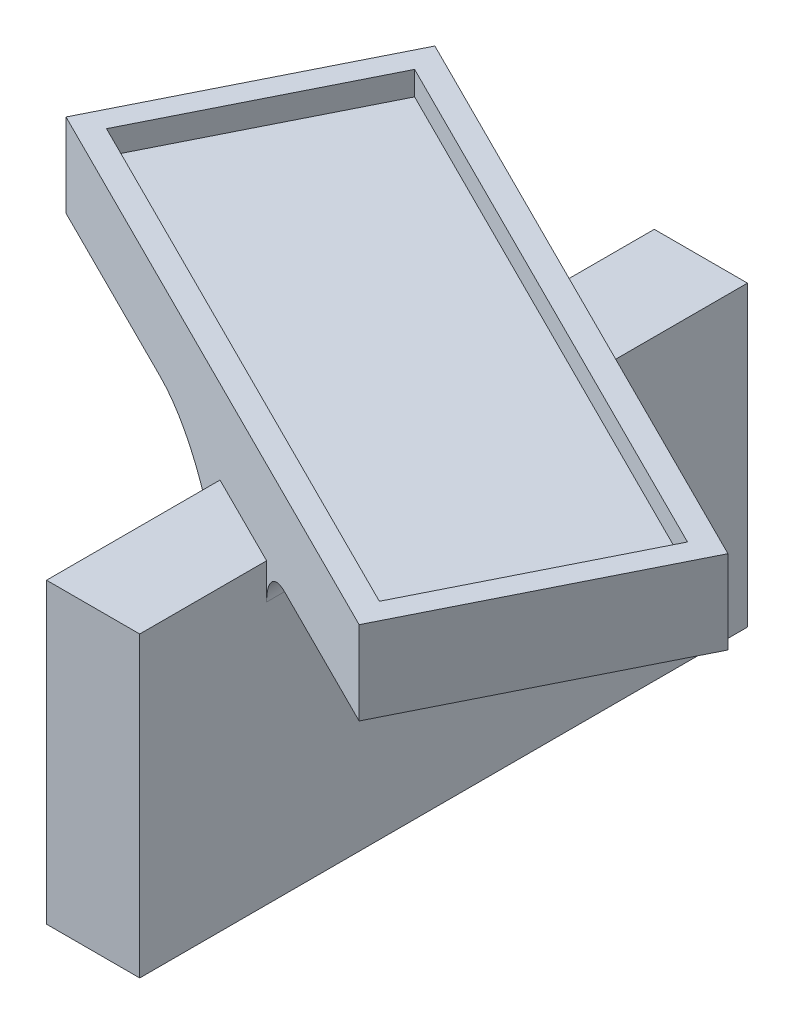
ISO-10303-21;
HEADER;
FILE_DESCRIPTION(('STEP AP214'),'2;1');
FILE_NAME('part.step','',(''),(''),'','','');
FILE_SCHEMA(('AUTOMOTIVE_DESIGN { 1 0 10303 214 1 1 1 1 }'));
ENDSEC;
DATA;
#1=APPLICATION_CONTEXT('core data for automotive mechanical design processes');
#2=APPLICATION_PROTOCOL_DEFINITION('international standard','automotive_design',2000,#1);
#3=PRODUCT_CONTEXT('',#1,'mechanical');
#4=PRODUCT('Part','Part','',(#3));
#5=PRODUCT_RELATED_PRODUCT_CATEGORY('part','',(#4));
#6=PRODUCT_DEFINITION_FORMATION('','',#4);
#7=PRODUCT_DEFINITION_CONTEXT('part definition',#1,'design');
#8=PRODUCT_DEFINITION('design','',#6,#7);
#9=PRODUCT_DEFINITION_SHAPE('','',#8);
#10=(LENGTH_UNIT() NAMED_UNIT(*) SI_UNIT(.MILLI.,.METRE.));
#11=(NAMED_UNIT(*) PLANE_ANGLE_UNIT() SI_UNIT($,.RADIAN.));
#12=(NAMED_UNIT(*) SI_UNIT($,.STERADIAN.) SOLID_ANGLE_UNIT());
#13=UNCERTAINTY_MEASURE_WITH_UNIT(LENGTH_MEASURE(1.E-05),#10,'distance_accuracy_value','');
#14=(GEOMETRIC_REPRESENTATION_CONTEXT(3) GLOBAL_UNCERTAINTY_ASSIGNED_CONTEXT((#13)) GLOBAL_UNIT_ASSIGNED_CONTEXT((#10,
#11,#12)) REPRESENTATION_CONTEXT('',''));
#15=CARTESIAN_POINT('',(0.,0.,0.));
#16=DIRECTION('',(0.,0.,1.));
#17=DIRECTION('',(1.,0.,0.));
#18=AXIS2_PLACEMENT_3D('',#15,#16,#17);
#19=CARTESIAN_POINT('',(-3.91,25.,25.5));
#20=DIRECTION('',(1.,0.,0.));
#21=DIRECTION('',(0.,0.,-1.));
#22=AXIS2_PLACEMENT_3D('',#19,#20,#21);
#23=PLANE('',#22);
#24=DIRECTION('',(0.,0.,1.));
#25=VECTOR('',#24,1.);
#26=CARTESIAN_POINT('',(-3.91,0.,25.5));
#27=LINE('',#26,#25);
#28=CARTESIAN_POINT('',(-3.91,0.,-25.5));
#29=VERTEX_POINT('',#28);
#30=CARTESIAN_POINT('',(-3.91,0.,-2.5));
#31=VERTEX_POINT('',#30);
#32=EDGE_CURVE('E325',#29,#31,#27,.T.);
#33=ORIENTED_EDGE('',*,*,#32,.T.);
#34=DIRECTION('',(0.,1.,0.));
#35=VECTOR('',#34,1.);
#36=CARTESIAN_POINT('',(-3.91,5.,-2.5));
#37=LINE('',#36,#35);
#38=CARTESIAN_POINT('',(-3.91,6.00000000000001,-2.5));
#39=VERTEX_POINT('',#38);
#40=EDGE_CURVE('E381',#31,#39,#37,.T.);
#41=ORIENTED_EDGE('',*,*,#40,.T.);
#42=DIRECTION('',(0.,0.,1.));
#43=VECTOR('',#42,1.);
#44=CARTESIAN_POINT('',(-3.91,6.00000000000001,1.5));
#45=LINE('',#44,#43);
#46=CARTESIAN_POINT('',(-3.91,6.00000000000001,2.5));
#47=VERTEX_POINT('',#46);
#48=EDGE_CURVE('E379',#39,#47,#45,.T.);
#49=ORIENTED_EDGE('',*,*,#48,.T.);
#50=DIRECTION('',(0.,-1.,0.));
#51=VECTOR('',#50,1.);
#52=CARTESIAN_POINT('',(-3.91,0.,2.5));
#53=LINE('',#52,#51);
#54=CARTESIAN_POINT('',(-3.91,0.,2.5));
#55=VERTEX_POINT('',#54);
#56=EDGE_CURVE('E377',#47,#55,#53,.T.);
#57=ORIENTED_EDGE('',*,*,#56,.T.);
#58=CARTESIAN_POINT('',(-3.91,0.,25.5));
#59=VERTEX_POINT('',#58);
#60=EDGE_CURVE('E324',#55,#59,#27,.T.);
#61=ORIENTED_EDGE('',*,*,#60,.T.);
#62=DIRECTION('',(0.,-1.,0.));
#63=VECTOR('',#62,1.);
#64=CARTESIAN_POINT('',(-3.91,25.,25.5));
#65=LINE('',#64,#63);
#66=CARTESIAN_POINT('',(-3.91,25.,25.5));
#67=VERTEX_POINT('',#66);
#68=EDGE_CURVE('E333',#67,#59,#65,.T.);
#69=ORIENTED_EDGE('',*,*,#68,.F.);
#70=DIRECTION('',(0.,0.,1.));
#71=VECTOR('',#70,1.);
#72=CARTESIAN_POINT('',(-3.91,25.,25.5));
#73=LINE('',#72,#71);
#74=CARTESIAN_POINT('',(-3.91,25.,10.9415220608544));
#75=VERTEX_POINT('',#74);
#76=EDGE_CURVE('E313',#75,#67,#73,.T.);
#77=ORIENTED_EDGE('',*,*,#76,.F.);
#78=DIRECTION('',(0.,-1.,0.));
#79=VECTOR('',#78,1.);
#80=CARTESIAN_POINT('',(-3.91,30.,10.9415220608544));
#81=LINE('',#80,#79);
#82=CARTESIAN_POINT('',(-3.91,15.,10.9415220608544));
#83=VERTEX_POINT('',#82);
#84=EDGE_CURVE('E350',#75,#83,#81,.T.);
#85=ORIENTED_EDGE('',*,*,#84,.T.);
#86=DIRECTION('',(0.,0.,1.));
#87=VECTOR('',#86,1.);
#88=CARTESIAN_POINT('',(-3.91,15.,-14.851522064765));
#89=LINE('',#88,#87);
#90=CARTESIAN_POINT('',(-3.91,15.,-14.851522064765));
#91=VERTEX_POINT('',#90);
#92=EDGE_CURVE('E347',#83,#91,#89,.F.);
#93=ORIENTED_EDGE('',*,*,#92,.T.);
#94=DIRECTION('',(0.,1.,0.));
#95=VECTOR('',#94,1.);
#96=CARTESIAN_POINT('',(-3.91,30.,-14.851522064765));
#97=LINE('',#96,#95);
#98=CARTESIAN_POINT('',(-3.90999999999999,25.,-14.851522064765));
#99=VERTEX_POINT('',#98);
#100=EDGE_CURVE('E345',#91,#99,#97,.T.);
#101=ORIENTED_EDGE('',*,*,#100,.T.);
#102=CARTESIAN_POINT('',(-3.91,25.,-25.5));
#103=VERTEX_POINT('',#102);
#104=EDGE_CURVE('E314',#103,#99,#73,.T.);
#105=ORIENTED_EDGE('',*,*,#104,.F.);
#106=DIRECTION('',(0.,-1.,0.));
#107=VECTOR('',#106,1.);
#108=CARTESIAN_POINT('',(-3.91,25.,-25.5));
#109=LINE('',#108,#107);
#110=EDGE_CURVE('E336',#103,#29,#109,.T.);
#111=ORIENTED_EDGE('',*,*,#110,.T.);
#112=EDGE_LOOP('',(#33,#41,#49,#57,#61,#69,#77,#85,#93,#101,#105,#111));
#113=FACE_BOUND('',#112,.T.);
#114=ADVANCED_FACE('F35',(#113),#23,.F.);
#115=CARTESIAN_POINT('',(0.,25.,0.));
#116=DIRECTION('',(0.,-1.,0.));
#117=DIRECTION('',(0.,0.,-1.));
#118=AXIS2_PLACEMENT_3D('',#115,#116,#117);
#119=PLANE('',#118);
#120=DIRECTION('',(0.894427190821003,0.,0.447213595857783));
#121=VECTOR('',#120,1.);
#122=CARTESIAN_POINT('',(-29.7553565757971,25.,-1.98115623996877));
#123=LINE('',#122,#121);
#124=CARTESIAN_POINT('',(3.91000000000001,25.,14.851522064765));
#125=VERTEX_POINT('',#124);
#126=EDGE_CURVE('E294',#75,#125,#123,.T.);
#127=ORIENTED_EDGE('',*,*,#126,.F.);
#128=ORIENTED_EDGE('',*,*,#76,.T.);
#129=DIRECTION('',(1.,0.,0.));
#130=VECTOR('',#129,1.);
#131=CARTESIAN_POINT('',(-3.91,25.,25.5));
#132=LINE('',#131,#130);
#133=CARTESIAN_POINT('',(3.91,25.,25.5));
#134=VERTEX_POINT('',#133);
#135=EDGE_CURVE('E317',#67,#134,#132,.T.);
#136=ORIENTED_EDGE('',*,*,#135,.T.);
#137=DIRECTION('',(0.,0.,-1.));
#138=VECTOR('',#137,1.);
#139=CARTESIAN_POINT('',(3.91,25.,25.5));
#140=LINE('',#139,#138);
#141=EDGE_CURVE('E307',#134,#125,#140,.T.);
#142=ORIENTED_EDGE('',*,*,#141,.T.);
#143=EDGE_LOOP('',(#127,#128,#136,#142));
#144=FACE_BOUND('',#143,.T.);
#145=ADVANCED_FACE('F438',(#144),#119,.F.);
#146=DIRECTION('',(-0.894427190821003,0.,-0.447213595857784));
#147=VECTOR('',#146,1.);
#148=CARTESIAN_POINT('',(29.7553565757971,25.,1.98115623996879));
#149=LINE('',#148,#147);
#150=CARTESIAN_POINT('',(3.91,25.,-10.9415220608544));
#151=VERTEX_POINT('',#150);
#152=EDGE_CURVE('E287',#151,#99,#149,.T.);
#153=ORIENTED_EDGE('',*,*,#152,.F.);
#154=CARTESIAN_POINT('',(3.91,25.,-25.5));
#155=VERTEX_POINT('',#154);
#156=EDGE_CURVE('E311',#151,#155,#140,.T.);
#157=ORIENTED_EDGE('',*,*,#156,.T.);
#158=DIRECTION('',(-1.,0.,0.));
#159=VECTOR('',#158,1.);
#160=CARTESIAN_POINT('',(-3.91,25.,-25.5));
#161=LINE('',#160,#159);
#162=EDGE_CURVE('E310',#155,#103,#161,.T.);
#163=ORIENTED_EDGE('',*,*,#162,.T.);
#164=ORIENTED_EDGE('',*,*,#104,.T.);
#165=EDGE_LOOP('',(#153,#157,#163,#164));
#166=FACE_BOUND('',#165,.T.);
#167=ADVANCED_FACE('F473',(#166),#119,.F.);
#168=CARTESIAN_POINT('',(3.91,25.,25.5));
#169=DIRECTION('',(-1.,0.,0.));
#170=DIRECTION('',(0.,0.,1.));
#171=AXIS2_PLACEMENT_3D('',#168,#169,#170);
#172=PLANE('',#171);
#173=ORIENTED_EDGE('',*,*,#156,.F.);
#174=DIRECTION('',(0.,-1.,0.));
#175=VECTOR('',#174,1.);
#176=CARTESIAN_POINT('',(3.91,30.,-10.9415220608544));
#177=LINE('',#176,#175);
#178=CARTESIAN_POINT('',(3.91,22.,-10.9415220608544));
#179=VERTEX_POINT('',#178);
#180=EDGE_CURVE('E365',#151,#179,#177,.T.);
#181=ORIENTED_EDGE('',*,*,#180,.T.);
#182=DIRECTION('',(0.,0.,-1.));
#183=VECTOR('',#182,1.);
#184=CARTESIAN_POINT('',(3.91,22.,14.851522064765));
#185=LINE('',#184,#183);
#186=CARTESIAN_POINT('',(3.91,22.,14.851522064765));
#187=VERTEX_POINT('',#186);
#188=EDGE_CURVE('E362',#179,#187,#185,.F.);
#189=ORIENTED_EDGE('',*,*,#188,.T.);
#190=DIRECTION('',(0.,1.,0.));
#191=VECTOR('',#190,1.);
#192=CARTESIAN_POINT('',(3.91,30.,14.851522064765));
#193=LINE('',#192,#191);
#194=EDGE_CURVE('E360',#187,#125,#193,.T.);
#195=ORIENTED_EDGE('',*,*,#194,.T.);
#196=ORIENTED_EDGE('',*,*,#141,.F.);
#197=DIRECTION('',(0.,-1.,0.));
#198=VECTOR('',#197,1.);
#199=CARTESIAN_POINT('',(3.91,25.,25.5));
#200=LINE('',#199,#198);
#201=CARTESIAN_POINT('',(3.91,0.,25.5));
#202=VERTEX_POINT('',#201);
#203=EDGE_CURVE('E319',#134,#202,#200,.T.);
#204=ORIENTED_EDGE('',*,*,#203,.T.);
#205=DIRECTION('',(0.,0.,-1.));
#206=VECTOR('',#205,1.);
#207=CARTESIAN_POINT('',(3.91,0.,25.5));
#208=LINE('',#207,#206);
#209=CARTESIAN_POINT('',(3.91,0.,-25.5));
#210=VERTEX_POINT('',#209);
#211=EDGE_CURVE('E306',#202,#210,#208,.T.);
#212=ORIENTED_EDGE('',*,*,#211,.T.);
#213=DIRECTION('',(0.,-1.,0.));
#214=VECTOR('',#213,1.);
#215=CARTESIAN_POINT('',(3.91,25.,-25.5));
#216=LINE('',#215,#214);
#217=EDGE_CURVE('E339',#155,#210,#216,.T.);
#218=ORIENTED_EDGE('',*,*,#217,.F.);
#219=EDGE_LOOP('',(#173,#181,#189,#195,#196,#204,#212,#218));
#220=FACE_BOUND('',#219,.T.);
#221=ADVANCED_FACE('F433',(#220),#172,.F.);
#222=CARTESIAN_POINT('',(-3.91,25.,-25.5));
#223=DIRECTION('',(0.,0.,1.));
#224=DIRECTION('',(1.,0.,0.));
#225=AXIS2_PLACEMENT_3D('',#222,#223,#224);
#226=PLANE('',#225);
#227=DIRECTION('',(-1.,0.,0.));
#228=VECTOR('',#227,1.);
#229=CARTESIAN_POINT('',(-3.91,0.,-25.5));
#230=LINE('',#229,#228);
#231=EDGE_CURVE('E322',#210,#29,#230,.T.);
#232=ORIENTED_EDGE('',*,*,#231,.T.);
#233=ORIENTED_EDGE('',*,*,#110,.F.);
#234=ORIENTED_EDGE('',*,*,#162,.F.);
#235=ORIENTED_EDGE('',*,*,#217,.T.);
#236=EDGE_LOOP('',(#232,#233,#234,#235));
#237=FACE_BOUND('',#236,.T.);
#238=ADVANCED_FACE('F478',(#237),#226,.F.);
#239=CARTESIAN_POINT('',(-3.91,25.,25.5));
#240=DIRECTION('',(0.,0.,-1.));
#241=DIRECTION('',(-1.,0.,0.));
#242=AXIS2_PLACEMENT_3D('',#239,#240,#241);
#243=PLANE('',#242);
#244=DIRECTION('',(1.,0.,0.));
#245=VECTOR('',#244,1.);
#246=CARTESIAN_POINT('',(-3.91,0.,25.5));
#247=LINE('',#246,#245);
#248=EDGE_CURVE('E328',#59,#202,#247,.T.);
#249=ORIENTED_EDGE('',*,*,#248,.T.);
#250=ORIENTED_EDGE('',*,*,#203,.F.);
#251=ORIENTED_EDGE('',*,*,#135,.F.);
#252=ORIENTED_EDGE('',*,*,#68,.T.);
#253=EDGE_LOOP('',(#249,#250,#251,#252));
#254=FACE_BOUND('',#253,.T.);
#255=ADVANCED_FACE('F425',(#254),#243,.F.);
#256=CARTESIAN_POINT('',(0.,0.,0.));
#257=DIRECTION('',(0.,-1.,0.));
#258=DIRECTION('',(0.,0.,-1.));
#259=AXIS2_PLACEMENT_3D('',#256,#257,#258);
#260=PLANE('',#259);
#261=ORIENTED_EDGE('',*,*,#211,.F.);
#262=ORIENTED_EDGE('',*,*,#248,.F.);
#263=ORIENTED_EDGE('',*,*,#60,.F.);
#264=DIRECTION('',(0.70710678118655,0.,0.707106781186545));
#265=VECTOR('',#264,1.);
#266=CARTESIAN_POINT('',(-4.91000000000001,0.,1.5));
#267=LINE('',#266,#265);
#268=CARTESIAN_POINT('',(-4.91000000000001,0.,1.5));
#269=VERTEX_POINT('',#268);
#270=EDGE_CURVE('E11',#55,#269,#267,.F.);
#271=ORIENTED_EDGE('',*,*,#270,.T.);
#272=DIRECTION('',(-1.,0.,0.));
#273=VECTOR('',#272,1.);
#274=CARTESIAN_POINT('',(-6.41,0.,1.5));
#275=LINE('',#274,#273);
#276=CARTESIAN_POINT('',(-3.91,0.,1.5));
#277=VERTEX_POINT('',#276);
#278=EDGE_CURVE('E51',#277,#269,#275,.T.);
#279=ORIENTED_EDGE('',*,*,#278,.F.);
#280=CARTESIAN_POINT('',(-3.91,0.,-1.5));
#281=VERTEX_POINT('',#280);
#282=EDGE_CURVE('E329',#281,#277,#27,.T.);
#283=ORIENTED_EDGE('',*,*,#282,.F.);
#284=DIRECTION('',(1.,0.,0.));
#285=VECTOR('',#284,1.);
#286=CARTESIAN_POINT('',(-6.41,0.,-1.5));
#287=LINE('',#286,#285);
#288=CARTESIAN_POINT('',(-4.91000000000001,0.,-1.5));
#289=VERTEX_POINT('',#288);
#290=EDGE_CURVE('E372',#289,#281,#287,.T.);
#291=ORIENTED_EDGE('',*,*,#290,.F.);
#292=DIRECTION('',(-0.70710678118655,0.,0.707106781186546));
#293=VECTOR('',#292,1.);
#294=CARTESIAN_POINT('',(-4.91000000000001,0.,-1.5));
#295=LINE('',#294,#293);
#296=EDGE_CURVE('E44',#289,#31,#295,.F.);
#297=ORIENTED_EDGE('',*,*,#296,.T.);
#298=ORIENTED_EDGE('',*,*,#32,.F.);
#299=ORIENTED_EDGE('',*,*,#231,.F.);
#300=EDGE_LOOP('',(#261,#262,#263,#271,#279,#283,#291,#297,#298,#299));
#301=FACE_BOUND('',#300,.T.);
#302=ADVANCED_FACE('F428',(#301),#260,.T.);
#303=CARTESIAN_POINT('',(0.,25.,0.));
#304=DIRECTION('',(0.,1.,0.));
#305=DIRECTION('',(0.,0.,1.));
#306=AXIS2_PLACEMENT_3D('',#303,#304,#305);
#307=PLANE('',#306);
#308=CARTESIAN_POINT('',(6.91000000000001,25.,16.3515220662653));
#309=VERTEX_POINT('',#308);
#310=CARTESIAN_POINT('',(19.438138919358,25.,22.6155915322093));
#311=VERTEX_POINT('',#310);
#312=EDGE_CURVE('E289',#309,#311,#123,.T.);
#313=ORIENTED_EDGE('',*,*,#312,.F.);
#314=DIRECTION('',(0.,0.,-1.));
#315=VECTOR('',#314,1.);
#316=CARTESIAN_POINT('',(6.91,25.,-10.9415220608544));
#317=LINE('',#316,#315);
#318=CARTESIAN_POINT('',(6.91000000000001,25.,-9.44152205935419));
#319=VERTEX_POINT('',#318);
#320=EDGE_CURVE('E357',#309,#319,#317,.T.);
#321=ORIENTED_EDGE('',*,*,#320,.T.);
#322=CARTESIAN_POINT('',(29.7553565757971,25.,1.98115623996879));
#323=VERTEX_POINT('',#322);
#324=EDGE_CURVE('E283',#323,#319,#149,.T.);
#325=ORIENTED_EDGE('',*,*,#324,.F.);
#326=DIRECTION('',(0.447213595857783,0.,-0.894427190821003));
#327=VECTOR('',#326,1.);
#328=CARTESIAN_POINT('',(19.438138919358,25.,22.6155915322093));
#329=LINE('',#328,#327);
#330=EDGE_CURVE('E279',#311,#323,#329,.T.);
#331=ORIENTED_EDGE('',*,*,#330,.F.);
#332=EDGE_LOOP('',(#313,#321,#325,#331));
#333=FACE_BOUND('',#332,.T.);
#334=ADVANCED_FACE('F451',(#333),#307,.F.);
#335=CARTESIAN_POINT('',(-13.91,25.,-19.8515220697658));
#336=VERTEX_POINT('',#335);
#337=CARTESIAN_POINT('',(-19.438138919358,25.,-22.6155915322093));
#338=VERTEX_POINT('',#337);
#339=EDGE_CURVE('E282',#336,#338,#149,.T.);
#340=ORIENTED_EDGE('',*,*,#339,.F.);
#341=DIRECTION('',(0.,0.,1.));
#342=VECTOR('',#341,1.);
#343=CARTESIAN_POINT('',(-13.91,25.,10.9415220608544));
#344=LINE('',#343,#342);
#345=CARTESIAN_POINT('',(-13.91,25.,5.94152205585368));
#346=VERTEX_POINT('',#345);
#347=EDGE_CURVE('E342',#336,#346,#344,.T.);
#348=ORIENTED_EDGE('',*,*,#347,.T.);
#349=CARTESIAN_POINT('',(-29.7553565757971,25.,-1.98115623996877));
#350=VERTEX_POINT('',#349);
#351=EDGE_CURVE('E290',#350,#346,#123,.T.);
#352=ORIENTED_EDGE('',*,*,#351,.F.);
#353=DIRECTION('',(-0.447213595857784,0.,0.894427190821003));
#354=VECTOR('',#353,1.);
#355=CARTESIAN_POINT('',(-19.438138919358,25.,-22.6155915322093));
#356=LINE('',#355,#354);
#357=EDGE_CURVE('E286',#338,#350,#356,.T.);
#358=ORIENTED_EDGE('',*,*,#357,.F.);
#359=EDGE_LOOP('',(#340,#348,#352,#358));
#360=FACE_BOUND('',#359,.T.);
#361=ADVANCED_FACE('F464',(#360),#307,.F.);
#362=CARTESIAN_POINT('',(19.438138919358,30.,22.6155915322093));
#363=DIRECTION('',(-0.894427190821003,0.,-0.447213595857783));
#364=DIRECTION('',(-0.447213595857783,0.,0.894427190821003));
#365=AXIS2_PLACEMENT_3D('',#362,#363,#364);
#366=PLANE('',#365);
#367=ORIENTED_EDGE('',*,*,#330,.T.);
#368=DIRECTION('',(0.,-1.,0.));
#369=VECTOR('',#368,1.);
#370=CARTESIAN_POINT('',(29.7553565757971,30.,1.98115623996879));
#371=LINE('',#370,#369);
#372=CARTESIAN_POINT('',(29.7553565757971,32.,1.98115623996878));
#373=VERTEX_POINT('',#372);
#374=EDGE_CURVE('E303',#373,#323,#371,.T.);
#375=ORIENTED_EDGE('',*,*,#374,.F.);
#376=DIRECTION('',(0.447213595857783,0.,-0.894427190821003));
#377=VECTOR('',#376,1.);
#378=CARTESIAN_POINT('',(24.5967477475776,32.,12.298373886089));
#379=LINE('',#378,#377);
#380=CARTESIAN_POINT('',(19.4381389193581,32.,22.6155915322093));
#381=VERTEX_POINT('',#380);
#382=EDGE_CURVE('E245',#381,#373,#379,.T.);
#383=ORIENTED_EDGE('',*,*,#382,.F.);
#384=DIRECTION('',(0.,-1.,0.));
#385=VECTOR('',#384,1.);
#386=CARTESIAN_POINT('',(19.438138919358,30.,22.6155915322093));
#387=LINE('',#386,#385);
#388=EDGE_CURVE('E293',#381,#311,#387,.T.);
#389=ORIENTED_EDGE('',*,*,#388,.T.);
#390=EDGE_LOOP('',(#367,#375,#383,#389));
#391=FACE_BOUND('',#390,.T.);
#392=ADVANCED_FACE('F450',(#391),#366,.F.);
#393=CARTESIAN_POINT('',(29.7553565757971,30.,1.98115623996879));
#394=DIRECTION('',(-0.447213595857784,0.,0.894427190821003));
#395=DIRECTION('',(0.894427190821003,0.,0.447213595857784));
#396=AXIS2_PLACEMENT_3D('',#393,#394,#395);
#397=PLANE('',#396);
#398=ORIENTED_EDGE('',*,*,#324,.T.);
#399=CARTESIAN_POINT('',(6.91,22.,-9.44152205935419));
#400=DIRECTION('',(-0.447213595857784,0.,0.894427190821003));
#401=DIRECTION('',(0.894427190821003,0.,0.447213595857784));
#402=AXIS2_PLACEMENT_3D('',#399,#400,#401);
#403=ELLIPSE('',#402,3.35410196692061,3.);
#404=EDGE_CURVE('E368',#319,#179,#403,.T.);
#405=ORIENTED_EDGE('',*,*,#404,.T.);
#406=ORIENTED_EDGE('',*,*,#180,.F.);
#407=ORIENTED_EDGE('',*,*,#152,.T.);
#408=ORIENTED_EDGE('',*,*,#100,.F.);
#409=CARTESIAN_POINT('',(-13.91,15.,-19.8515220697658));
#410=DIRECTION('',(-0.447213595857784,0.,0.894427190821003));
#411=DIRECTION('',(-0.894427190821003,0.,-0.447213595857784));
#412=AXIS2_PLACEMENT_3D('',#409,#410,#411);
#413=ELLIPSE('',#412,11.1803398897354,10.);
#414=EDGE_CURVE('E355',#91,#336,#413,.T.);
#415=ORIENTED_EDGE('',*,*,#414,.T.);
#416=ORIENTED_EDGE('',*,*,#339,.T.);
#417=DIRECTION('',(0.,-1.,0.));
#418=VECTOR('',#417,1.);
#419=CARTESIAN_POINT('',(-19.438138919358,30.,-22.6155915322093));
#420=LINE('',#419,#418);
#421=CARTESIAN_POINT('',(-19.438138919358,32.,-22.6155915322093));
#422=VERTEX_POINT('',#421);
#423=EDGE_CURVE('E300',#422,#338,#420,.T.);
#424=ORIENTED_EDGE('',*,*,#423,.F.);
#425=DIRECTION('',(-0.894427190821003,0.,-0.447213595857784));
#426=VECTOR('',#425,1.);
#427=CARTESIAN_POINT('',(5.15860882821953,32.,-10.3172176461203));
#428=LINE('',#427,#426);
#429=EDGE_CURVE('E249',#373,#422,#428,.T.);
#430=ORIENTED_EDGE('',*,*,#429,.F.);
#431=ORIENTED_EDGE('',*,*,#374,.T.);
#432=EDGE_LOOP('',(#398,#405,#406,#407,#408,#415,#416,#424,#430,#431));
#433=FACE_BOUND('',#432,.T.);
#434=ADVANCED_FACE('F454',(#433),#397,.F.);
#435=CARTESIAN_POINT('',(-19.438138919358,30.,-22.6155915322093));
#436=DIRECTION('',(0.894427190821003,0.,0.447213595857784));
#437=DIRECTION('',(0.447213595857784,0.,-0.894427190821003));
#438=AXIS2_PLACEMENT_3D('',#435,#436,#437);
#439=PLANE('',#438);
#440=ORIENTED_EDGE('',*,*,#357,.T.);
#441=DIRECTION('',(0.,-1.,0.));
#442=VECTOR('',#441,1.);
#443=CARTESIAN_POINT('',(-29.7553565757971,30.,-1.98115623996877));
#444=LINE('',#443,#442);
#445=CARTESIAN_POINT('',(-29.7553565757971,32.,-1.98115623996877));
#446=VERTEX_POINT('',#445);
#447=EDGE_CURVE('E297',#446,#350,#444,.T.);
#448=ORIENTED_EDGE('',*,*,#447,.F.);
#449=DIRECTION('',(-0.447213595857784,0.,0.894427190821003));
#450=VECTOR('',#449,1.);
#451=CARTESIAN_POINT('',(-24.5967477475776,32.,-12.2983738860891));
#452=LINE('',#451,#450);
#453=EDGE_CURVE('E252',#422,#446,#452,.T.);
#454=ORIENTED_EDGE('',*,*,#453,.F.);
#455=ORIENTED_EDGE('',*,*,#423,.T.);
#456=EDGE_LOOP('',(#440,#448,#454,#455));
#457=FACE_BOUND('',#456,.T.);
#458=ADVANCED_FACE('F550',(#457),#439,.F.);
#459=CARTESIAN_POINT('',(-29.7553565757971,30.,-1.98115623996877));
#460=DIRECTION('',(0.447213595857783,0.,-0.894427190821003));
#461=DIRECTION('',(-0.894427190821003,0.,-0.447213595857783));
#462=AXIS2_PLACEMENT_3D('',#459,#460,#461);
#463=PLANE('',#462);
#464=ORIENTED_EDGE('',*,*,#351,.T.);
#465=CARTESIAN_POINT('',(-13.91,15.,5.94152205585368));
#466=DIRECTION('',(0.447213595857783,0.,-0.894427190821003));
#467=DIRECTION('',(-0.894427190821003,0.,-0.447213595857784));
#468=AXIS2_PLACEMENT_3D('',#465,#466,#467);
#469=ELLIPSE('',#468,11.1803398897354,10.);
#470=EDGE_CURVE('E353',#346,#83,#469,.T.);
#471=ORIENTED_EDGE('',*,*,#470,.T.);
#472=ORIENTED_EDGE('',*,*,#84,.F.);
#473=ORIENTED_EDGE('',*,*,#126,.T.);
#474=ORIENTED_EDGE('',*,*,#194,.F.);
#475=CARTESIAN_POINT('',(6.91,22.,16.3515220662653));
#476=DIRECTION('',(0.447213595857783,0.,-0.894427190821003));
#477=DIRECTION('',(0.894427190821003,0.,0.447213595857784));
#478=AXIS2_PLACEMENT_3D('',#475,#476,#477);
#479=ELLIPSE('',#478,3.35410196692061,3.);
#480=EDGE_CURVE('E370',#187,#309,#479,.T.);
#481=ORIENTED_EDGE('',*,*,#480,.T.);
#482=ORIENTED_EDGE('',*,*,#312,.T.);
#483=ORIENTED_EDGE('',*,*,#388,.F.);
#484=DIRECTION('',(0.894427190821003,0.,0.447213595857783));
#485=VECTOR('',#484,1.);
#486=CARTESIAN_POINT('',(-5.15860882821953,32.,10.3172176461203));
#487=LINE('',#486,#485);
#488=EDGE_CURVE('E242',#446,#381,#487,.T.);
#489=ORIENTED_EDGE('',*,*,#488,.F.);
#490=ORIENTED_EDGE('',*,*,#447,.T.);
#491=EDGE_LOOP('',(#464,#471,#472,#473,#474,#481,#482,#483,#489,#490));
#492=FACE_BOUND('',#491,.T.);
#493=ADVANCED_FACE('F440',(#492),#463,.F.);
#494=CARTESIAN_POINT('',(22.8973360850177,32.,11.4486680539593));
#495=DIRECTION('',(0.894427190821003,0.,0.447213595857784));
#496=DIRECTION('',(0.447213595857784,0.,-0.894427190821003));
#497=AXIS2_PLACEMENT_3D('',#494,#495,#496);
#498=PLANE('',#497);
#499=DIRECTION('',(-0.447213595857784,0.,0.894427190821003));
#500=VECTOR('',#499,1.);
#501=CARTESIAN_POINT('',(22.8973360850177,30.,11.4486680539593));
#502=LINE('',#501,#500);
#503=CARTESIAN_POINT('',(27.2062390811074,30.,2.8308620703989));
#504=VERTEX_POINT('',#503);
#505=CARTESIAN_POINT('',(18.5884330889279,30.,20.0664740375196));
#506=VERTEX_POINT('',#505);
#507=EDGE_CURVE('E233',#504,#506,#502,.T.);
#508=ORIENTED_EDGE('',*,*,#507,.T.);
#509=DIRECTION('',(0.,-1.,0.));
#510=VECTOR('',#509,1.);
#511=CARTESIAN_POINT('',(18.5884330889279,32.,20.0664740375196));
#512=LINE('',#511,#510);
#513=CARTESIAN_POINT('',(18.5884330889279,32.,20.0664740375196));
#514=VERTEX_POINT('',#513);
#515=EDGE_CURVE('E277',#514,#506,#512,.T.);
#516=ORIENTED_EDGE('',*,*,#515,.F.);
#517=DIRECTION('',(-0.447213595857784,0.,0.894427190821003));
#518=VECTOR('',#517,1.);
#519=CARTESIAN_POINT('',(22.8973360850177,32.,11.4486680539593));
#520=LINE('',#519,#518);
#521=CARTESIAN_POINT('',(27.2062390811074,32.,2.8308620703989));
#522=VERTEX_POINT('',#521);
#523=EDGE_CURVE('E255',#522,#514,#520,.T.);
#524=ORIENTED_EDGE('',*,*,#523,.F.);
#525=DIRECTION('',(0.,-1.,0.));
#526=VECTOR('',#525,1.);
#527=CARTESIAN_POINT('',(27.2062390811074,32.,2.8308620703989));
#528=LINE('',#527,#526);
#529=EDGE_CURVE('E263',#522,#504,#528,.T.);
#530=ORIENTED_EDGE('',*,*,#529,.T.);
#531=EDGE_LOOP('',(#508,#516,#524,#530));
#532=FACE_BOUND('',#531,.T.);
#533=ADVANCED_FACE('F549',(#532),#498,.F.);
#534=CARTESIAN_POINT('',(-4.30890299608974,32.,8.61780598356037));
#535=DIRECTION('',(-0.447213595857783,0.,0.894427190821003));
#536=DIRECTION('',(0.894427190821003,0.,0.447213595857783));
#537=AXIS2_PLACEMENT_3D('',#534,#535,#536);
#538=PLANE('',#537);
#539=DIRECTION('',(-0.894427190821003,0.,-0.447213595857783));
#540=VECTOR('',#539,1.);
#541=CARTESIAN_POINT('',(-4.30890299608974,30.,8.61780598356037));
#542=LINE('',#541,#540);
#543=CARTESIAN_POINT('',(-27.2062390811074,30.,-2.83086207039888));
#544=VERTEX_POINT('',#543);
#545=EDGE_CURVE('E236',#506,#544,#542,.T.);
#546=ORIENTED_EDGE('',*,*,#545,.T.);
#547=DIRECTION('',(0.,-1.,0.));
#548=VECTOR('',#547,1.);
#549=CARTESIAN_POINT('',(-27.2062390811074,32.,-2.83086207039888));
#550=LINE('',#549,#548);
#551=CARTESIAN_POINT('',(-27.2062390811074,32.,-2.83086207039888));
#552=VERTEX_POINT('',#551);
#553=EDGE_CURVE('E274',#552,#544,#550,.T.);
#554=ORIENTED_EDGE('',*,*,#553,.F.);
#555=DIRECTION('',(-0.894427190821003,0.,-0.447213595857783));
#556=VECTOR('',#555,1.);
#557=CARTESIAN_POINT('',(-4.30890299608974,32.,8.61780598356037));
#558=LINE('',#557,#556);
#559=EDGE_CURVE('E258',#514,#552,#558,.T.);
#560=ORIENTED_EDGE('',*,*,#559,.F.);
#561=ORIENTED_EDGE('',*,*,#515,.T.);
#562=EDGE_LOOP('',(#546,#554,#560,#561));
#563=FACE_BOUND('',#562,.T.);
#564=ADVANCED_FACE('F635',(#563),#538,.F.);
#565=CARTESIAN_POINT('',(-22.8973360850177,32.,-11.4486680539593));
#566=DIRECTION('',(-0.894427190821003,0.,-0.447213595857784));
#567=DIRECTION('',(-0.447213595857784,0.,0.894427190821003));
#568=AXIS2_PLACEMENT_3D('',#565,#566,#567);
#569=PLANE('',#568);
#570=DIRECTION('',(0.447213595857784,0.,-0.894427190821003));
#571=VECTOR('',#570,1.);
#572=CARTESIAN_POINT('',(-22.8973360850177,30.,-11.4486680539593));
#573=LINE('',#572,#571);
#574=CARTESIAN_POINT('',(-18.5884330889279,30.,-20.0664740375196));
#575=VERTEX_POINT('',#574);
#576=EDGE_CURVE('E266',#544,#575,#573,.T.);
#577=ORIENTED_EDGE('',*,*,#576,.T.);
#578=DIRECTION('',(0.,-1.,0.));
#579=VECTOR('',#578,1.);
#580=CARTESIAN_POINT('',(-18.5884330889279,32.,-20.0664740375196));
#581=LINE('',#580,#579);
#582=CARTESIAN_POINT('',(-18.5884330889279,32.,-20.0664740375196));
#583=VERTEX_POINT('',#582);
#584=EDGE_CURVE('E272',#583,#575,#581,.T.);
#585=ORIENTED_EDGE('',*,*,#584,.F.);
#586=DIRECTION('',(0.447213595857784,0.,-0.894427190821003));
#587=VECTOR('',#586,1.);
#588=CARTESIAN_POINT('',(-22.8973360850177,32.,-11.4486680539593));
#589=LINE('',#588,#587);
#590=EDGE_CURVE('E260',#552,#583,#589,.T.);
#591=ORIENTED_EDGE('',*,*,#590,.F.);
#592=ORIENTED_EDGE('',*,*,#553,.T.);
#593=EDGE_LOOP('',(#577,#585,#591,#592));
#594=FACE_BOUND('',#593,.T.);
#595=ADVANCED_FACE('F625',(#594),#569,.F.);
#596=CARTESIAN_POINT('',(4.30890299608974,32.,-8.61780598356036));
#597=DIRECTION('',(0.447213595857784,0.,-0.894427190821003));
#598=DIRECTION('',(-0.894427190821003,0.,-0.447213595857784));
#599=AXIS2_PLACEMENT_3D('',#596,#597,#598);
#600=PLANE('',#599);
#601=DIRECTION('',(0.894427190821003,0.,0.447213595857784));
#602=VECTOR('',#601,1.);
#603=CARTESIAN_POINT('',(4.30890299608974,30.,-8.61780598356036));
#604=LINE('',#603,#602);
#605=EDGE_CURVE('E246',#575,#504,#604,.T.);
#606=ORIENTED_EDGE('',*,*,#605,.T.);
#607=ORIENTED_EDGE('',*,*,#529,.F.);
#608=DIRECTION('',(0.894427190821003,0.,0.447213595857784));
#609=VECTOR('',#608,1.);
#610=CARTESIAN_POINT('',(4.30890299608974,32.,-8.61780598356036));
#611=LINE('',#610,#609);
#612=EDGE_CURVE('E262',#583,#522,#611,.T.);
#613=ORIENTED_EDGE('',*,*,#612,.F.);
#614=ORIENTED_EDGE('',*,*,#584,.T.);
#615=EDGE_LOOP('',(#606,#607,#613,#614));
#616=FACE_BOUND('',#615,.T.);
#617=ADVANCED_FACE('F616',(#616),#600,.F.);
#618=CARTESIAN_POINT('',(0.,32.,0.));
#619=DIRECTION('',(0.,1.,0.));
#620=DIRECTION('',(0.,0.,1.));
#621=AXIS2_PLACEMENT_3D('',#618,#619,#620);
#622=PLANE('',#621);
#623=ORIENTED_EDGE('',*,*,#488,.T.);
#624=ORIENTED_EDGE('',*,*,#382,.T.);
#625=ORIENTED_EDGE('',*,*,#429,.T.);
#626=ORIENTED_EDGE('',*,*,#453,.T.);
#627=EDGE_LOOP('',(#623,#624,#625,#626));
#628=FACE_BOUND('',#627,.T.);
#629=ORIENTED_EDGE('',*,*,#523,.T.);
#630=ORIENTED_EDGE('',*,*,#559,.T.);
#631=ORIENTED_EDGE('',*,*,#590,.T.);
#632=ORIENTED_EDGE('',*,*,#612,.T.);
#633=EDGE_LOOP('',(#629,#630,#631,#632));
#634=FACE_BOUND('',#633,.T.);
#635=ADVANCED_FACE('F456',(#628,#634),#622,.T.);
#636=CARTESIAN_POINT('',(0.,30.,0.));
#637=DIRECTION('',(0.,1.,0.));
#638=DIRECTION('',(0.,0.,1.));
#639=AXIS2_PLACEMENT_3D('',#636,#637,#638);
#640=PLANE('',#639);
#641=ORIENTED_EDGE('',*,*,#545,.F.);
#642=ORIENTED_EDGE('',*,*,#507,.F.);
#643=ORIENTED_EDGE('',*,*,#605,.F.);
#644=ORIENTED_EDGE('',*,*,#576,.F.);
#645=EDGE_LOOP('',(#641,#642,#643,#644));
#646=FACE_BOUND('',#645,.T.);
#647=ADVANCED_FACE('F506',(#646),#640,.T.);
#648=CARTESIAN_POINT('',(-13.91,15.,0.));
#649=DIRECTION('',(0.,0.,-1.));
#650=DIRECTION('',(-1.,0.,0.));
#651=AXIS2_PLACEMENT_3D('',#648,#649,#650);
#652=CYLINDRICAL_SURFACE('',#651,10.);
#653=ORIENTED_EDGE('',*,*,#414,.F.);
#654=ORIENTED_EDGE('',*,*,#92,.F.);
#655=ORIENTED_EDGE('',*,*,#470,.F.);
#656=ORIENTED_EDGE('',*,*,#347,.F.);
#657=EDGE_LOOP('',(#653,#654,#655,#656));
#658=FACE_BOUND('',#657,.T.);
#659=ADVANCED_FACE('F468',(#658),#652,.F.);
#660=CARTESIAN_POINT('',(6.91,22.,0.));
#661=DIRECTION('',(0.,0.,1.));
#662=DIRECTION('',(1.,0.,0.));
#663=AXIS2_PLACEMENT_3D('',#660,#661,#662);
#664=CYLINDRICAL_SURFACE('',#663,3.);
#665=ORIENTED_EDGE('',*,*,#480,.F.);
#666=ORIENTED_EDGE('',*,*,#188,.F.);
#667=ORIENTED_EDGE('',*,*,#404,.F.);
#668=ORIENTED_EDGE('',*,*,#320,.F.);
#669=EDGE_LOOP('',(#665,#666,#667,#668));
#670=FACE_BOUND('',#669,.T.);
#671=ADVANCED_FACE('F505',(#670),#664,.F.);
#672=CARTESIAN_POINT('',(-6.41,-5.,1.5));
#673=DIRECTION('',(0.,0.,-1.));
#674=DIRECTION('',(-1.,0.,0.));
#675=AXIS2_PLACEMENT_3D('',#672,#673,#674);
#676=PLANE('',#675);
#677=ORIENTED_EDGE('',*,*,#278,.T.);
#678=DIRECTION('',(0.,1.,0.));
#679=VECTOR('',#678,1.);
#680=CARTESIAN_POINT('',(-4.91000000000001,5.,1.5));
#681=LINE('',#680,#679);
#682=CARTESIAN_POINT('',(-4.91000000000001,5.,1.5));
#683=VERTEX_POINT('',#682);
#684=EDGE_CURVE('E232',#269,#683,#681,.T.);
#685=ORIENTED_EDGE('',*,*,#684,.T.);
#686=DIRECTION('',(1.,0.,0.));
#687=VECTOR('',#686,1.);
#688=CARTESIAN_POINT('',(-6.41,5.,1.5));
#689=LINE('',#688,#687);
#690=CARTESIAN_POINT('',(-6.41,5.,1.5));
#691=VERTEX_POINT('',#690);
#692=EDGE_CURVE('E212',#691,#683,#689,.T.);
#693=ORIENTED_EDGE('',*,*,#692,.F.);
#694=DIRECTION('',(0.,1.,0.));
#695=VECTOR('',#694,1.);
#696=CARTESIAN_POINT('',(-6.41,-5.,1.5));
#697=LINE('',#696,#695);
#698=CARTESIAN_POINT('',(-6.41,-5.,1.5));
#699=VERTEX_POINT('',#698);
#700=EDGE_CURVE('E219',#699,#691,#697,.T.);
#701=ORIENTED_EDGE('',*,*,#700,.F.);
#702=DIRECTION('',(1.,0.,0.));
#703=VECTOR('',#702,1.);
#704=CARTESIAN_POINT('',(-6.41,-5.,1.5));
#705=LINE('',#704,#703);
#706=CARTESIAN_POINT('',(-3.91,-5.,1.5));
#707=VERTEX_POINT('',#706);
#708=EDGE_CURVE('E407',#699,#707,#705,.T.);
#709=ORIENTED_EDGE('',*,*,#708,.T.);
#710=DIRECTION('',(0.,1.,0.));
#711=VECTOR('',#710,1.);
#712=CARTESIAN_POINT('',(-3.91,-5.,1.5));
#713=LINE('',#712,#711);
#714=EDGE_CURVE('E394',#707,#277,#713,.T.);
#715=ORIENTED_EDGE('',*,*,#714,.T.);
#716=EDGE_LOOP('',(#677,#685,#693,#701,#709,#715));
#717=FACE_BOUND('',#716,.T.);
#718=ADVANCED_FACE('F230',(#717),#676,.F.);
#719=CARTESIAN_POINT('',(-6.41,5.,-1.5));
#720=DIRECTION('',(0.,-1.,0.));
#721=DIRECTION('',(0.,0.,-1.));
#722=AXIS2_PLACEMENT_3D('',#719,#720,#721);
#723=PLANE('',#722);
#724=ORIENTED_EDGE('',*,*,#692,.T.);
#725=DIRECTION('',(0.,0.,-1.));
#726=VECTOR('',#725,1.);
#727=CARTESIAN_POINT('',(-4.91000000000001,5.,-1.5));
#728=LINE('',#727,#726);
#729=CARTESIAN_POINT('',(-4.91000000000001,5.,-1.5));
#730=VERTEX_POINT('',#729);
#731=EDGE_CURVE('E383',#683,#730,#728,.T.);
#732=ORIENTED_EDGE('',*,*,#731,.T.);
#733=DIRECTION('',(1.,0.,0.));
#734=VECTOR('',#733,1.);
#735=CARTESIAN_POINT('',(-6.41,5.,-1.5));
#736=LINE('',#735,#734);
#737=CARTESIAN_POINT('',(-6.41,5.,-1.5));
#738=VERTEX_POINT('',#737);
#739=EDGE_CURVE('E215',#738,#730,#736,.T.);
#740=ORIENTED_EDGE('',*,*,#739,.F.);
#741=DIRECTION('',(0.,0.,-1.));
#742=VECTOR('',#741,1.);
#743=CARTESIAN_POINT('',(-6.41,5.,-1.5));
#744=LINE('',#743,#742);
#745=EDGE_CURVE('E208',#691,#738,#744,.T.);
#746=ORIENTED_EDGE('',*,*,#745,.F.);
#747=EDGE_LOOP('',(#724,#732,#740,#746));
#748=FACE_BOUND('',#747,.T.);
#749=ADVANCED_FACE('F210',(#748),#723,.F.);
#750=CARTESIAN_POINT('',(-6.41,-5.,-1.5));
#751=DIRECTION('',(0.,0.,1.));
#752=DIRECTION('',(1.,0.,0.));
#753=AXIS2_PLACEMENT_3D('',#750,#751,#752);
#754=PLANE('',#753);
#755=ORIENTED_EDGE('',*,*,#739,.T.);
#756=DIRECTION('',(0.,-1.,0.));
#757=VECTOR('',#756,1.);
#758=CARTESIAN_POINT('',(-4.91000000000001,0.,-1.5));
#759=LINE('',#758,#757);
#760=EDGE_CURVE('E374',#730,#289,#759,.T.);
#761=ORIENTED_EDGE('',*,*,#760,.T.);
#762=ORIENTED_EDGE('',*,*,#290,.T.);
#763=DIRECTION('',(0.,-1.,0.));
#764=VECTOR('',#763,1.);
#765=CARTESIAN_POINT('',(-3.91,-5.,-1.5));
#766=LINE('',#765,#764);
#767=CARTESIAN_POINT('',(-3.91,-5.,-1.5));
#768=VERTEX_POINT('',#767);
#769=EDGE_CURVE('E398',#281,#768,#766,.T.);
#770=ORIENTED_EDGE('',*,*,#769,.T.);
#771=DIRECTION('',(1.,0.,0.));
#772=VECTOR('',#771,1.);
#773=CARTESIAN_POINT('',(-6.41,-5.,-1.5));
#774=LINE('',#773,#772);
#775=CARTESIAN_POINT('',(-6.41,-5.,-1.5));
#776=VERTEX_POINT('',#775);
#777=EDGE_CURVE('E238',#776,#768,#774,.T.);
#778=ORIENTED_EDGE('',*,*,#777,.F.);
#779=DIRECTION('',(0.,-1.,0.));
#780=VECTOR('',#779,1.);
#781=CARTESIAN_POINT('',(-6.41,-5.,-1.5));
#782=LINE('',#781,#780);
#783=EDGE_CURVE('E218',#738,#776,#782,.T.);
#784=ORIENTED_EDGE('',*,*,#783,.F.);
#785=EDGE_LOOP('',(#755,#761,#762,#770,#778,#784));
#786=FACE_BOUND('',#785,.T.);
#787=ADVANCED_FACE('F481',(#786),#754,.F.);
#788=CARTESIAN_POINT('',(-6.41,-5.,-1.5));
#789=DIRECTION('',(0.,1.,0.));
#790=DIRECTION('',(0.,0.,1.));
#791=AXIS2_PLACEMENT_3D('',#788,#789,#790);
#792=PLANE('',#791);
#793=DIRECTION('',(0.,0.,1.));
#794=VECTOR('',#793,1.);
#795=CARTESIAN_POINT('',(-3.91,-5.,-1.5));
#796=LINE('',#795,#794);
#797=EDGE_CURVE('E228',#768,#707,#796,.T.);
#798=ORIENTED_EDGE('',*,*,#797,.T.);
#799=ORIENTED_EDGE('',*,*,#708,.F.);
#800=DIRECTION('',(0.,0.,1.));
#801=VECTOR('',#800,1.);
#802=CARTESIAN_POINT('',(-6.41,-5.,-1.5));
#803=LINE('',#802,#801);
#804=EDGE_CURVE('E224',#776,#699,#803,.T.);
#805=ORIENTED_EDGE('',*,*,#804,.F.);
#806=ORIENTED_EDGE('',*,*,#777,.T.);
#807=EDGE_LOOP('',(#798,#799,#805,#806));
#808=FACE_BOUND('',#807,.T.);
#809=ADVANCED_FACE('F412',(#808),#792,.F.);
#810=CARTESIAN_POINT('',(-6.41,0.,0.));
#811=DIRECTION('',(1.,0.,0.));
#812=DIRECTION('',(0.,0.,-1.));
#813=AXIS2_PLACEMENT_3D('',#810,#811,#812);
#814=PLANE('',#813);
#815=ORIENTED_EDGE('',*,*,#700,.T.);
#816=ORIENTED_EDGE('',*,*,#745,.T.);
#817=ORIENTED_EDGE('',*,*,#783,.T.);
#818=ORIENTED_EDGE('',*,*,#804,.T.);
#819=EDGE_LOOP('',(#815,#816,#817,#818));
#820=FACE_BOUND('',#819,.T.);
#821=ADVANCED_FACE('F222',(#820),#814,.F.);
#822=CARTESIAN_POINT('',(-3.91,0.,0.));
#823=DIRECTION('',(1.,0.,0.));
#824=DIRECTION('',(0.,0.,-1.));
#825=AXIS2_PLACEMENT_3D('',#822,#823,#824);
#826=PLANE('',#825);
#827=ORIENTED_EDGE('',*,*,#769,.F.);
#828=ORIENTED_EDGE('',*,*,#282,.T.);
#829=ORIENTED_EDGE('',*,*,#714,.F.);
#830=ORIENTED_EDGE('',*,*,#797,.F.);
#831=EDGE_LOOP('',(#827,#828,#829,#830));
#832=FACE_BOUND('',#831,.T.);
#833=ADVANCED_FACE('F416',(#832),#826,.T.);
#834=CARTESIAN_POINT('',(-4.91000000000001,-5.,1.5));
#835=DIRECTION('',(-0.707106781186545,0.,0.70710678118655));
#836=DIRECTION('',(0.,-1.,0.));
#837=AXIS2_PLACEMENT_3D('',#834,#835,#836);
#838=PLANE('',#837);
#839=ORIENTED_EDGE('',*,*,#270,.F.);
#840=ORIENTED_EDGE('',*,*,#56,.F.);
#841=DIRECTION('',(-0.577350269189629,-0.577350269189625,-0.577350269189624));
#842=VECTOR('',#841,1.);
#843=CARTESIAN_POINT('',(-8.24333333333335,1.66666666666668,-1.83333333333332));
#844=LINE('',#843,#842);
#845=EDGE_CURVE('E39',#683,#47,#844,.F.);
#846=ORIENTED_EDGE('',*,*,#845,.F.);
#847=ORIENTED_EDGE('',*,*,#684,.F.);
#848=EDGE_LOOP('',(#839,#840,#846,#847));
#849=FACE_BOUND('',#848,.T.);
#850=ADVANCED_FACE('F37',(#849),#838,.T.);
#851=CARTESIAN_POINT('',(-4.91000000000001,5.,-1.5));
#852=DIRECTION('',(-0.707106781186545,0.70710678118655,0.));
#853=DIRECTION('',(0.,0.,1.));
#854=AXIS2_PLACEMENT_3D('',#851,#852,#853);
#855=PLANE('',#854);
#856=ORIENTED_EDGE('',*,*,#845,.T.);
#857=ORIENTED_EDGE('',*,*,#48,.F.);
#858=DIRECTION('',(-0.577350269189628,-0.577350269189625,0.577350269189625));
#859=VECTOR('',#858,1.);
#860=CARTESIAN_POINT('',(-4.91000000000001,5.,-1.5));
#861=LINE('',#860,#859);
#862=EDGE_CURVE('E387',#730,#39,#861,.F.);
#863=ORIENTED_EDGE('',*,*,#862,.F.);
#864=ORIENTED_EDGE('',*,*,#731,.F.);
#865=EDGE_LOOP('',(#856,#857,#863,#864));
#866=FACE_BOUND('',#865,.T.);
#867=ADVANCED_FACE('F480',(#866),#855,.T.);
#868=CARTESIAN_POINT('',(-4.91000000000001,-5.,-1.5));
#869=DIRECTION('',(-0.707106781186546,0.,-0.70710678118655));
#870=DIRECTION('',(0.,1.,0.));
#871=AXIS2_PLACEMENT_3D('',#868,#869,#870);
#872=PLANE('',#871);
#873=ORIENTED_EDGE('',*,*,#862,.T.);
#874=ORIENTED_EDGE('',*,*,#40,.F.);
#875=ORIENTED_EDGE('',*,*,#296,.F.);
#876=ORIENTED_EDGE('',*,*,#760,.F.);
#877=EDGE_LOOP('',(#873,#874,#875,#876));
#878=FACE_BOUND('',#877,.T.);
#879=ADVANCED_FACE('F479',(#878),#872,.T.);
#880=CLOSED_SHELL('',(#114,#145,#167,#221,#238,#255,#302,#334,#361,#392,#434,#458,#493,#533,
#564,#595,#617,#635,#647,#659,#671,#718,#749,#787,#809,#821,#833,#850,#867,#879));
#881=MANIFOLD_SOLID_BREP('B2',#880);
#882=ADVANCED_BREP_SHAPE_REPRESENTATION('',(#18,#881),#14);
#883=SHAPE_DEFINITION_REPRESENTATION(#9,#882);
ENDSEC;
END-ISO-10303-21;
